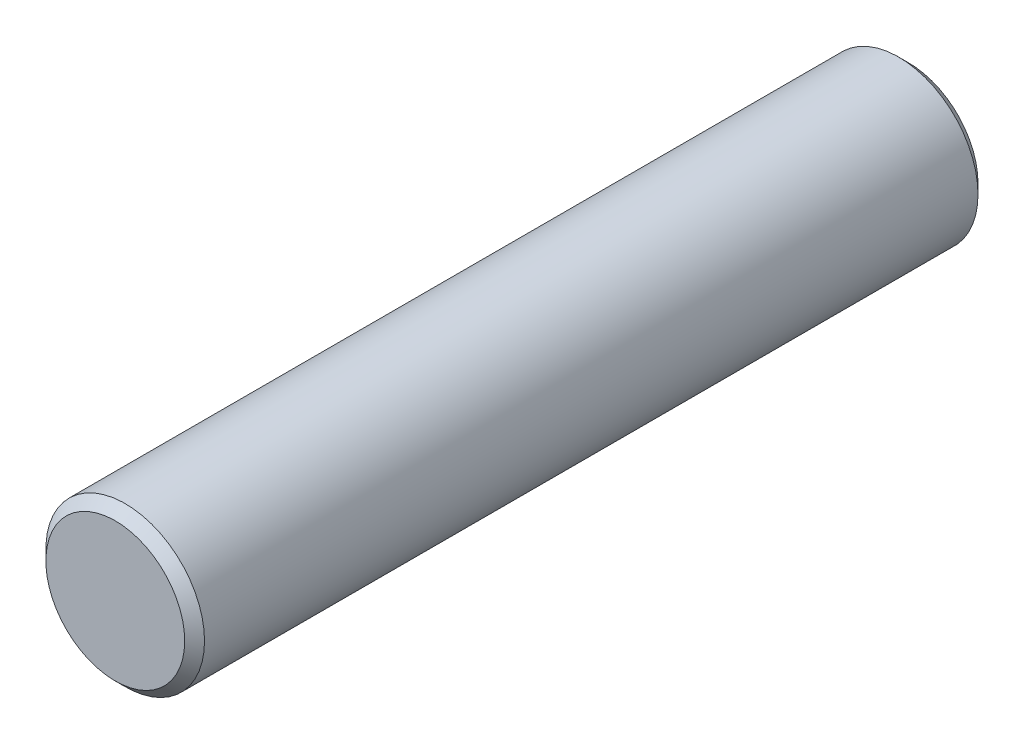
ISO-10303-21;
HEADER;
FILE_DESCRIPTION(('STEP AP214'),'2;1');
FILE_NAME('part.step','',(''),(''),'','','');
FILE_SCHEMA(('AUTOMOTIVE_DESIGN { 1 0 10303 214 1 1 1 1 }'));
ENDSEC;
DATA;
#1=APPLICATION_CONTEXT('core data for automotive mechanical design processes');
#2=APPLICATION_PROTOCOL_DEFINITION('international standard','automotive_design',2000,#1);
#3=PRODUCT_CONTEXT('',#1,'mechanical');
#4=PRODUCT('Part','Part','',(#3));
#5=PRODUCT_RELATED_PRODUCT_CATEGORY('part','',(#4));
#6=PRODUCT_DEFINITION_FORMATION('','',#4);
#7=PRODUCT_DEFINITION_CONTEXT('part definition',#1,'design');
#8=PRODUCT_DEFINITION('design','',#6,#7);
#9=PRODUCT_DEFINITION_SHAPE('','',#8);
#10=(LENGTH_UNIT() NAMED_UNIT(*) SI_UNIT(.MILLI.,.METRE.));
#11=(NAMED_UNIT(*) PLANE_ANGLE_UNIT() SI_UNIT($,.RADIAN.));
#12=(NAMED_UNIT(*) SI_UNIT($,.STERADIAN.) SOLID_ANGLE_UNIT());
#13=UNCERTAINTY_MEASURE_WITH_UNIT(LENGTH_MEASURE(1.E-05),#10,'distance_accuracy_value','');
#14=(GEOMETRIC_REPRESENTATION_CONTEXT(3) GLOBAL_UNCERTAINTY_ASSIGNED_CONTEXT((#13)) GLOBAL_UNIT_ASSIGNED_CONTEXT((#10,
#11,#12)) REPRESENTATION_CONTEXT('',''));
#15=CARTESIAN_POINT('',(0.,0.,0.));
#16=DIRECTION('',(0.,0.,1.));
#17=DIRECTION('',(1.,0.,0.));
#18=AXIS2_PLACEMENT_3D('',#15,#16,#17);
#19=CARTESIAN_POINT('',(0.,0.,20.));
#20=DIRECTION('',(0.,0.,-1.));
#21=DIRECTION('',(-1.,0.,0.));
#22=AXIS2_PLACEMENT_3D('',#19,#20,#21);
#23=CYLINDRICAL_SURFACE('',#22,4.);
#24=CARTESIAN_POINT('',(0.,0.,19.5));
#25=DIRECTION('',(0.,0.,1.));
#26=DIRECTION('',(1.,0.,0.));
#27=AXIS2_PLACEMENT_3D('',#24,#25,#26);
#28=CIRCLE('',#27,4.);
#29=CARTESIAN_POINT('',(4.,0.,19.5));
#30=VERTEX_POINT('',#29);
#31=EDGE_CURVE('E37',#30,#30,#28,.F.);
#32=ORIENTED_EDGE('',*,*,#31,.T.);
#33=EDGE_LOOP('',(#32));
#34=FACE_BOUND('',#33,.T.);
#35=CARTESIAN_POINT('',(0.,0.,-19.5));
#36=DIRECTION('',(0.,0.,1.));
#37=DIRECTION('',(1.,0.,0.));
#38=AXIS2_PLACEMENT_3D('',#35,#36,#37);
#39=CIRCLE('',#38,4.);
#40=CARTESIAN_POINT('',(4.,0.,-19.5));
#41=VERTEX_POINT('',#40);
#42=EDGE_CURVE('E41',#41,#41,#39,.T.);
#43=ORIENTED_EDGE('',*,*,#42,.T.);
#44=EDGE_LOOP('',(#43));
#45=FACE_BOUND('',#44,.T.);
#46=ADVANCED_FACE('F30',(#34,#45),#23,.T.);
#47=CARTESIAN_POINT('',(0.,0.,20.));
#48=DIRECTION('',(0.,0.,1.));
#49=DIRECTION('',(1.,0.,0.));
#50=AXIS2_PLACEMENT_3D('',#47,#48,#49);
#51=PLANE('',#50);
#52=CARTESIAN_POINT('',(0.,0.,20.));
#53=DIRECTION('',(0.,0.,1.));
#54=DIRECTION('',(1.,0.,0.));
#55=AXIS2_PLACEMENT_3D('',#52,#53,#54);
#56=CIRCLE('',#55,3.5);
#57=CARTESIAN_POINT('',(3.5,0.,20.));
#58=VERTEX_POINT('',#57);
#59=EDGE_CURVE('E45',#58,#58,#56,.T.);
#60=ORIENTED_EDGE('',*,*,#59,.T.);
#61=EDGE_LOOP('',(#60));
#62=FACE_BOUND('',#61,.T.);
#63=ADVANCED_FACE('F51',(#62),#51,.T.);
#64=CARTESIAN_POINT('',(0.,0.,-20.));
#65=DIRECTION('',(0.,0.,1.));
#66=DIRECTION('',(1.,0.,0.));
#67=AXIS2_PLACEMENT_3D('',#64,#65,#66);
#68=PLANE('',#67);
#69=CARTESIAN_POINT('',(0.,0.,-20.));
#70=DIRECTION('',(0.,0.,1.));
#71=DIRECTION('',(1.,0.,0.));
#72=AXIS2_PLACEMENT_3D('',#69,#70,#71);
#73=CIRCLE('',#72,3.50000000000001);
#74=CARTESIAN_POINT('',(3.50000000000001,0.,-20.));
#75=VERTEX_POINT('',#74);
#76=EDGE_CURVE('E10',#75,#75,#73,.F.);
#77=ORIENTED_EDGE('',*,*,#76,.T.);
#78=EDGE_LOOP('',(#77));
#79=FACE_BOUND('',#78,.T.);
#80=ADVANCED_FACE('F55',(#79),#68,.F.);
#81=CARTESIAN_POINT('',(0.,0.,20.));
#82=DIRECTION('',(0.,0.,-1.));
#83=DIRECTION('',(-1.,0.,0.));
#84=AXIS2_PLACEMENT_3D('',#81,#82,#83);
#85=CONICAL_SURFACE('',#84,3.5,0.785398163397452);
#86=ORIENTED_EDGE('',*,*,#31,.F.);
#87=EDGE_LOOP('',(#86));
#88=FACE_BOUND('',#87,.T.);
#89=ORIENTED_EDGE('',*,*,#59,.F.);
#90=EDGE_LOOP('',(#89));
#91=FACE_BOUND('',#90,.T.);
#92=ADVANCED_FACE('F53',(#88,#91),#85,.T.);
#93=CARTESIAN_POINT('',(0.,0.,-19.5));
#94=DIRECTION('',(0.,0.,1.));
#95=DIRECTION('',(1.,0.,0.));
#96=AXIS2_PLACEMENT_3D('',#93,#94,#95);
#97=CONICAL_SURFACE('',#96,4.,0.785398163397448);
#98=ORIENTED_EDGE('',*,*,#76,.F.);
#99=EDGE_LOOP('',(#98));
#100=FACE_BOUND('',#99,.T.);
#101=ORIENTED_EDGE('',*,*,#42,.F.);
#102=EDGE_LOOP('',(#101));
#103=FACE_BOUND('',#102,.T.);
#104=ADVANCED_FACE('F32',(#100,#103),#97,.T.);
#105=CLOSED_SHELL('',(#46,#63,#80,#92,#104));
#106=MANIFOLD_SOLID_BREP('B2',#105);
#107=ADVANCED_BREP_SHAPE_REPRESENTATION('',(#18,#106),#14);
#108=SHAPE_DEFINITION_REPRESENTATION(#9,#107);
ENDSEC;
END-ISO-10303-21;
